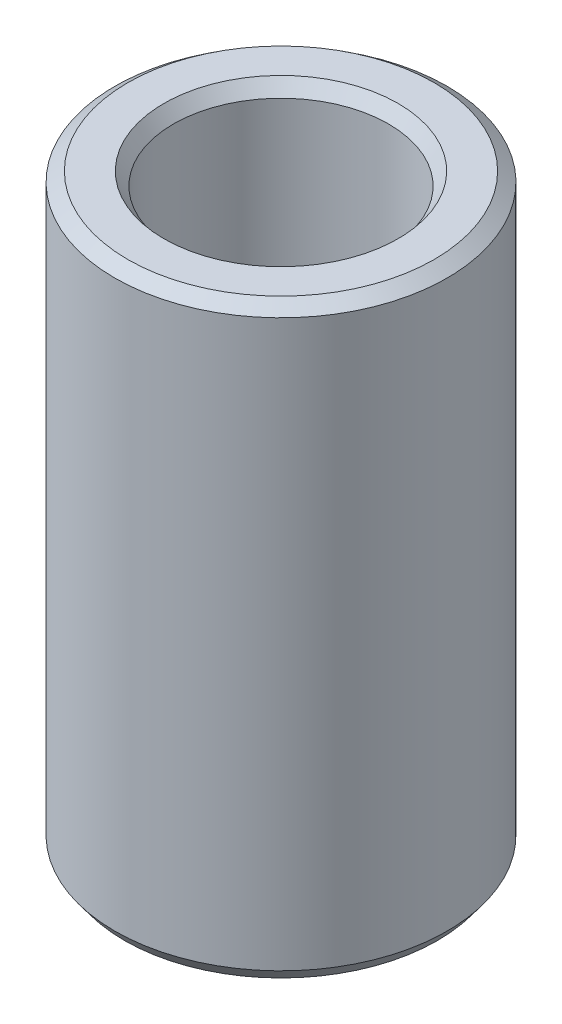
ISO-10303-21;
HEADER;
FILE_DESCRIPTION(('STEP AP214'),'2;1');
FILE_NAME('part.step','',(''),(''),'','','');
FILE_SCHEMA(('AUTOMOTIVE_DESIGN { 1 0 10303 214 1 1 1 1 }'));
ENDSEC;
DATA;
#1=APPLICATION_CONTEXT('core data for automotive mechanical design processes');
#2=APPLICATION_PROTOCOL_DEFINITION('international standard','automotive_design',2000,#1);
#3=PRODUCT_CONTEXT('',#1,'mechanical');
#4=PRODUCT('Part','Part','',(#3));
#5=PRODUCT_RELATED_PRODUCT_CATEGORY('part','',(#4));
#6=PRODUCT_DEFINITION_FORMATION('','',#4);
#7=PRODUCT_DEFINITION_CONTEXT('part definition',#1,'design');
#8=PRODUCT_DEFINITION('design','',#6,#7);
#9=PRODUCT_DEFINITION_SHAPE('','',#8);
#10=(LENGTH_UNIT() NAMED_UNIT(*) SI_UNIT(.MILLI.,.METRE.));
#11=(NAMED_UNIT(*) PLANE_ANGLE_UNIT() SI_UNIT($,.RADIAN.));
#12=(NAMED_UNIT(*) SI_UNIT($,.STERADIAN.) SOLID_ANGLE_UNIT());
#13=UNCERTAINTY_MEASURE_WITH_UNIT(LENGTH_MEASURE(1.E-05),#10,'distance_accuracy_value','');
#14=(GEOMETRIC_REPRESENTATION_CONTEXT(3) GLOBAL_UNCERTAINTY_ASSIGNED_CONTEXT((#13)) GLOBAL_UNIT_ASSIGNED_CONTEXT((#10,
#11,#12)) REPRESENTATION_CONTEXT('',''));
#15=CARTESIAN_POINT('',(0.,0.,0.));
#16=DIRECTION('',(0.,0.,1.));
#17=DIRECTION('',(1.,0.,0.));
#18=AXIS2_PLACEMENT_3D('',#15,#16,#17);
#19=CARTESIAN_POINT('',(0.,132.735458222468,0.));
#20=DIRECTION('',(0.,-1.,0.));
#21=DIRECTION('',(0.,0.,-1.));
#22=AXIS2_PLACEMENT_3D('',#19,#20,#21);
#23=CYLINDRICAL_SURFACE('',#22,37.5);
#24=CARTESIAN_POINT('',(0.,2.92556681524816,0.));
#25=DIRECTION('',(0.,1.,0.));
#26=DIRECTION('',(0.,0.,1.));
#27=AXIS2_PLACEMENT_3D('',#24,#25,#26);
#28=CIRCLE('',#27,37.5);
#29=CARTESIAN_POINT('',(0.,2.92556681524814,-37.5));
#30=VERTEX_POINT('',#29);
#31=EDGE_CURVE('E10',#30,#30,#28,.T.);
#32=CARTESIAN_POINT('',(0.,130.571420907143,0.));
#33=DIRECTION('',(0.,1.,0.));
#34=DIRECTION('',(0.,0.,1.));
#35=AXIS2_PLACEMENT_3D('',#32,#33,#34);
#36=CIRCLE('',#35,37.5);
#37=CARTESIAN_POINT('',(0.,130.571420907143,-37.5));
#38=VERTEX_POINT('',#37);
#39=EDGE_CURVE('E50',#38,#38,#36,.F.);
#40=CARTESIAN_POINT('',(0.,2.92556681524814,-37.5));
#41=CARTESIAN_POINT('',(0.,4.25521112870537,-37.5));
#42=CARTESIAN_POINT('',(0.,5.5848554421626,-37.5));
#43=CARTESIAN_POINT('',(0.,8.24414406907707,-37.5));
#44=CARTESIAN_POINT('',(0.,9.57378838253431,-37.5));
#45=CARTESIAN_POINT('',(0.,12.2330770094488,-37.5));
#46=CARTESIAN_POINT('',(0.,13.562721322906,-37.5));
#47=CARTESIAN_POINT('',(0.,16.2220099498205,-37.5));
#48=CARTESIAN_POINT('',(0.,17.5516542632777,-37.5));
#49=CARTESIAN_POINT('',(0.,20.2109428901922,-37.5));
#50=CARTESIAN_POINT('',(0.,21.5405872036494,-37.5));
#51=CARTESIAN_POINT('',(0.,24.1998758305639,-37.5));
#52=CARTESIAN_POINT('',(0.,25.5295201440211,-37.5));
#53=CARTESIAN_POINT('',(0.,28.1888087709356,-37.5));
#54=CARTESIAN_POINT('',(0.,29.5184530843928,-37.5));
#55=CARTESIAN_POINT('',(0.,32.1777417113073,-37.5));
#56=CARTESIAN_POINT('',(0.,33.5073860247645,-37.5));
#57=CARTESIAN_POINT('',(0.,36.166674651679,-37.5));
#58=CARTESIAN_POINT('',(0.,37.4963189651363,-37.5));
#59=CARTESIAN_POINT('',(0.,40.1556075920507,-37.5));
#60=CARTESIAN_POINT('',(0.,41.485251905508,-37.5));
#61=CARTESIAN_POINT('',(0.,44.1445405324224,-37.5));
#62=CARTESIAN_POINT('',(0.,45.4741848458797,-37.5));
#63=CARTESIAN_POINT('',(0.,48.1334734727941,-37.5));
#64=CARTESIAN_POINT('',(0.,49.4631177862514,-37.5));
#65=CARTESIAN_POINT('',(0.,52.1224064131659,-37.5));
#66=CARTESIAN_POINT('',(0.,53.4520507266231,-37.5));
#67=CARTESIAN_POINT('',(0.,56.1113393535376,-37.5));
#68=CARTESIAN_POINT('',(0.,57.4409836669948,-37.5));
#69=CARTESIAN_POINT('',(0.,60.1002722939093,-37.5));
#70=CARTESIAN_POINT('',(0.,61.4299166073665,-37.5));
#71=CARTESIAN_POINT('',(0.,64.089205234281,-37.5));
#72=CARTESIAN_POINT('',(0.,65.4188495477382,-37.5));
#73=CARTESIAN_POINT('',(0.,68.0781381746527,-37.5));
#74=CARTESIAN_POINT('',(0.,69.4077824881099,-37.5));
#75=CARTESIAN_POINT('',(0.,72.0670711150244,-37.5));
#76=CARTESIAN_POINT('',(0.,73.3967154284816,-37.5));
#77=CARTESIAN_POINT('',(0.,76.0560040553961,-37.5));
#78=CARTESIAN_POINT('',(0.,77.3856483688533,-37.5));
#79=CARTESIAN_POINT('',(0.,80.0449369957678,-37.5));
#80=CARTESIAN_POINT('',(0.,81.3745813092251,-37.5));
#81=CARTESIAN_POINT('',(0.,84.0338699361395,-37.5));
#82=CARTESIAN_POINT('',(0.,85.3635142495967,-37.5));
#83=CARTESIAN_POINT('',(0.,88.0228028765112,-37.5));
#84=CARTESIAN_POINT('',(0.,89.3524471899684,-37.5));
#85=CARTESIAN_POINT('',(0.,92.0117358168829,-37.5));
#86=CARTESIAN_POINT('',(0.,93.3413801303402,-37.5));
#87=CARTESIAN_POINT('',(0.,96.0006687572546,-37.5));
#88=CARTESIAN_POINT('',(0.,97.3303130707119,-37.5));
#89=CARTESIAN_POINT('',(0.,99.9896016976263,-37.5));
#90=CARTESIAN_POINT('',(0.,101.319246011084,-37.5));
#91=CARTESIAN_POINT('',(0.,103.978534637998,-37.5));
#92=CARTESIAN_POINT('',(0.,105.308178951455,-37.5));
#93=CARTESIAN_POINT('',(0.,107.96746757837,-37.5));
#94=CARTESIAN_POINT('',(0.,109.297111891827,-37.5));
#95=CARTESIAN_POINT('',(0.,111.956400518741,-37.5));
#96=CARTESIAN_POINT('',(0.,113.286044832199,-37.5));
#97=CARTESIAN_POINT('',(0.,115.945333459113,-37.5));
#98=CARTESIAN_POINT('',(0.,117.27497777257,-37.5));
#99=CARTESIAN_POINT('',(0.,119.934266399485,-37.5));
#100=CARTESIAN_POINT('',(0.,121.263910712942,-37.5));
#101=CARTESIAN_POINT('',(0.,123.923199339857,-37.5));
#102=CARTESIAN_POINT('',(0.,125.252843653314,-37.5));
#103=CARTESIAN_POINT('',(0.,127.912132280228,-37.5));
#104=CARTESIAN_POINT('',(0.,129.241776593686,-37.5));
#105=CARTESIAN_POINT('',(0.,130.571420907143,-37.5));
#106=B_SPLINE_CURVE_WITH_KNOTS('',3,(#40,#41,#42,#43,#44,#45,#46,#47,#48,#49,#50,#51,#52,#53,
#54,#55,#56,#57,#58,#59,#60,#61,#62,#63,#64,#65,#66,#67,#68,#69,#70,#71,#72,#73,#74,#75,#76,#77,
#78,#79,#80,#81,#82,#83,#84,#85,#86,#87,#88,#89,#90,#91,#92,#93,#94,#95,#96,#97,#98,#99,#100,
#101,#102,#103,#104,#105),.UNSPECIFIED.,.F.,.F.,(4,2,2,2,2,2,2,2,2,2,2,2,2,2,2,2,2,2,2,2,2,2,2,
2,2,2,2,2,2,2,2,2,4),(0.,3.9889329403717,7.97786588074341,11.9667988211151,15.9557317614868,
19.9446647018585,23.9335976422302,27.9225305826019,31.9114635229737,35.9003964633454,
39.8893294037171,43.8782623440888,47.8671952844605,51.8561282248322,55.8450611652039,
59.8339941055756,63.8229270459473,67.811859986319,71.8007929266907,75.7897258670624,
79.7786588074342,83.7675917478059,87.7565246881775,91.7454576285493,95.734390568921,
99.7233235092927,103.712256449664,107.701189390036,111.690122330408,115.67905527078,
119.667988211151,123.656921151523,127.645854091895),.UNSPECIFIED.);
#107=EDGE_CURVE('BSEAM39',#30,#38,#106,.T.);
#108=ORIENTED_EDGE('',*,*,#31,.T.);
#109=ORIENTED_EDGE('',*,*,#39,.T.);
#110=ORIENTED_EDGE('',*,*,#107,.T.);
#111=ORIENTED_EDGE('',*,*,#107,.F.);
#112=EDGE_LOOP('',(#108,#110,#109,#111));
#113=FACE_BOUND('',#112,.T.);
#114=ADVANCED_FACE('F39',(#113),#23,.T.);
#115=CARTESIAN_POINT('',(0.,132.735458222468,0.));
#116=DIRECTION('',(0.,1.,0.));
#117=DIRECTION('',(0.,0.,1.));
#118=AXIS2_PLACEMENT_3D('',#115,#116,#117);
#119=PLANE('',#118);
#120=CARTESIAN_POINT('',(0.,132.735458222468,0.));
#121=DIRECTION('',(0.,1.,0.));
#122=DIRECTION('',(0.,0.,1.));
#123=AXIS2_PLACEMENT_3D('',#120,#121,#122);
#124=CIRCLE('',#123,26.4444026323219);
#125=CARTESIAN_POINT('',(0.,132.735458222468,26.4444026323219));
#126=VERTEX_POINT('',#125);
#127=EDGE_CURVE('E58',#126,#126,#124,.F.);
#128=ORIENTED_EDGE('',*,*,#127,.T.);
#129=EDGE_LOOP('',(#128));
#130=FACE_BOUND('',#129,.T.);
#131=CARTESIAN_POINT('',(0.,132.735458222468,0.));
#132=DIRECTION('',(0.,1.,0.));
#133=DIRECTION('',(0.,0.,1.));
#134=AXIS2_PLACEMENT_3D('',#131,#132,#133);
#135=CIRCLE('',#134,34.5744331847522);
#136=CARTESIAN_POINT('',(0.,132.735458222468,34.5744331847522));
#137=VERTEX_POINT('',#136);
#138=EDGE_CURVE('E61',#137,#137,#135,.T.);
#139=ORIENTED_EDGE('',*,*,#138,.T.);
#140=EDGE_LOOP('',(#139));
#141=FACE_BOUND('',#140,.T.);
#142=ADVANCED_FACE('F88',(#130,#141),#119,.T.);
#143=CARTESIAN_POINT('',(0.,0.,0.));
#144=DIRECTION('',(0.,1.,0.));
#145=DIRECTION('',(0.,0.,1.));
#146=AXIS2_PLACEMENT_3D('',#143,#144,#145);
#147=PLANE('',#146);
#148=CARTESIAN_POINT('',(0.,0.,0.));
#149=DIRECTION('',(0.,1.,0.));
#150=DIRECTION('',(0.,0.,1.));
#151=AXIS2_PLACEMENT_3D('',#148,#149,#150);
#152=CIRCLE('',#151,27.205932132244);
#153=CARTESIAN_POINT('',(0.,0.,27.205932132244));
#154=VERTEX_POINT('',#153);
#155=EDGE_CURVE('E51',#154,#154,#152,.T.);
#156=ORIENTED_EDGE('',*,*,#155,.T.);
#157=EDGE_LOOP('',(#156));
#158=FACE_BOUND('',#157,.T.);
#159=CARTESIAN_POINT('',(0.,0.,0.));
#160=DIRECTION('',(0.,1.,0.));
#161=DIRECTION('',(0.,0.,1.));
#162=AXIS2_PLACEMENT_3D('',#159,#160,#161);
#163=CIRCLE('',#162,35.3359626846742);
#164=CARTESIAN_POINT('',(0.,0.,35.3359626846742));
#165=VERTEX_POINT('',#164);
#166=EDGE_CURVE('E54',#165,#165,#163,.F.);
#167=ORIENTED_EDGE('',*,*,#166,.T.);
#168=EDGE_LOOP('',(#167));
#169=FACE_BOUND('',#168,.T.);
#170=ADVANCED_FACE('F83',(#158,#169),#147,.F.);
#171=CARTESIAN_POINT('',(0.,132.735458222468,0.));
#172=DIRECTION('',(0.,-1.,0.));
#173=DIRECTION('',(0.,0.,-1.));
#174=AXIS2_PLACEMENT_3D('',#171,#172,#173);
#175=CYLINDRICAL_SURFACE('',#174,24.2803653169961);
#176=CARTESIAN_POINT('',(0.,129.80989140722,0.));
#177=DIRECTION('',(0.,1.,0.));
#178=DIRECTION('',(0.,0.,1.));
#179=AXIS2_PLACEMENT_3D('',#176,#177,#178);
#180=CIRCLE('',#179,24.2803653169961);
#181=CARTESIAN_POINT('',(0.,129.80989140722,-24.2803653169961));
#182=VERTEX_POINT('',#181);
#183=EDGE_CURVE('E67',#182,#182,#180,.T.);
#184=CARTESIAN_POINT('',(0.,2.16403731532563,0.));
#185=DIRECTION('',(0.,1.,0.));
#186=DIRECTION('',(0.,0.,1.));
#187=AXIS2_PLACEMENT_3D('',#184,#185,#186);
#188=CIRCLE('',#187,24.2803653169961);
#189=CARTESIAN_POINT('',(0.,2.16403731532561,-24.2803653169961));
#190=VERTEX_POINT('',#189);
#191=EDGE_CURVE('E69',#190,#190,#188,.F.);
#192=CARTESIAN_POINT('',(0.,129.80989140722,-24.2803653169961));
#193=CARTESIAN_POINT('',(0.,128.480247093763,-24.2803653169961));
#194=CARTESIAN_POINT('',(0.,127.150602780306,-24.2803653169961));
#195=CARTESIAN_POINT('',(0.,124.491314153391,-24.2803653169961));
#196=CARTESIAN_POINT('',(0.,123.161669839934,-24.2803653169961));
#197=CARTESIAN_POINT('',(0.,120.50238121302,-24.2803653169961));
#198=CARTESIAN_POINT('',(0.,119.172736899562,-24.2803653169961));
#199=CARTESIAN_POINT('',(0.,116.513448272648,-24.2803653169961));
#200=CARTESIAN_POINT('',(0.,115.183803959191,-24.2803653169961));
#201=CARTESIAN_POINT('',(0.,112.524515332276,-24.2803653169961));
#202=CARTESIAN_POINT('',(0.,111.194871018819,-24.2803653169961));
#203=CARTESIAN_POINT('',(0.,108.535582391905,-24.2803653169961));
#204=CARTESIAN_POINT('',(0.,107.205938078447,-24.2803653169961));
#205=CARTESIAN_POINT('',(0.,104.546649451533,-24.2803653169961));
#206=CARTESIAN_POINT('',(0.,103.217005138076,-24.2803653169961));
#207=CARTESIAN_POINT('',(0.,100.557716511161,-24.2803653169961));
#208=CARTESIAN_POINT('',(0.,99.2280721977039,-24.2803653169961));
#209=CARTESIAN_POINT('',(0.,96.5687835707894,-24.2803653169961));
#210=CARTESIAN_POINT('',(0.,95.2391392573322,-24.2803653169961));
#211=CARTESIAN_POINT('',(0.,92.5798506304177,-24.2803653169961));
#212=CARTESIAN_POINT('',(0.,91.2502063169604,-24.2803653169961));
#213=CARTESIAN_POINT('',(0.,88.590917690046,-24.2803653169961));
#214=CARTESIAN_POINT('',(0.,87.2612733765887,-24.2803653169961));
#215=CARTESIAN_POINT('',(0.,84.6019847496743,-24.2803653169961));
#216=CARTESIAN_POINT('',(0.,83.272340436217,-24.2803653169961));
#217=CARTESIAN_POINT('',(0.,80.6130518093026,-24.2803653169961));
#218=CARTESIAN_POINT('',(0.,79.2834074958453,-24.2803653169961));
#219=CARTESIAN_POINT('',(0.,76.6241188689309,-24.2803653169961));
#220=CARTESIAN_POINT('',(0.,75.2944745554736,-24.2803653169961));
#221=CARTESIAN_POINT('',(0.,72.6351859285592,-24.2803653169961));
#222=CARTESIAN_POINT('',(0.,71.3055416151019,-24.2803653169961));
#223=CARTESIAN_POINT('',(0.,68.6462529881874,-24.2803653169961));
#224=CARTESIAN_POINT('',(0.,67.3166086747302,-24.2803653169961));
#225=CARTESIAN_POINT('',(0.,64.6573200478157,-24.2803653169961));
#226=CARTESIAN_POINT('',(0.,63.3276757343585,-24.2803653169961));
#227=CARTESIAN_POINT('',(0.,60.668387107444,-24.2803653169961));
#228=CARTESIAN_POINT('',(0.,59.3387427939868,-24.2803653169961));
#229=CARTESIAN_POINT('',(0.,56.6794541670723,-24.2803653169961));
#230=CARTESIAN_POINT('',(0.,55.3498098536151,-24.2803653169961));
#231=CARTESIAN_POINT('',(0.,52.6905212267006,-24.2803653169961));
#232=CARTESIAN_POINT('',(0.,51.3608769132434,-24.2803653169961));
#233=CARTESIAN_POINT('',(0.,48.7015882863289,-24.2803653169961));
#234=CARTESIAN_POINT('',(0.,47.3719439728716,-24.2803653169961));
#235=CARTESIAN_POINT('',(0.,44.7126553459572,-24.2803653169961));
#236=CARTESIAN_POINT('',(0.,43.3830110324999,-24.2803653169961));
#237=CARTESIAN_POINT('',(0.,40.7237224055855,-24.2803653169961));
#238=CARTESIAN_POINT('',(0.,39.3940780921282,-24.2803653169961));
#239=CARTESIAN_POINT('',(0.,36.7347894652138,-24.2803653169961));
#240=CARTESIAN_POINT('',(0.,35.4051451517565,-24.2803653169961));
#241=CARTESIAN_POINT('',(0.,32.745856524842,-24.2803653169961));
#242=CARTESIAN_POINT('',(0.,31.4162122113848,-24.2803653169961));
#243=CARTESIAN_POINT('',(0.,28.7569235844703,-24.2803653169961));
#244=CARTESIAN_POINT('',(0.,27.4272792710131,-24.2803653169961));
#245=CARTESIAN_POINT('',(0.,24.7679906440986,-24.2803653169961));
#246=CARTESIAN_POINT('',(0.,23.4383463306414,-24.2803653169961));
#247=CARTESIAN_POINT('',(0.,20.7790577037269,-24.2803653169961));
#248=CARTESIAN_POINT('',(0.,19.4494133902697,-24.2803653169961));
#249=CARTESIAN_POINT('',(0.,16.7901247633552,-24.2803653169961));
#250=CARTESIAN_POINT('',(0.,15.460480449898,-24.2803653169961));
#251=CARTESIAN_POINT('',(0.,12.8011918229835,-24.2803653169961));
#252=CARTESIAN_POINT('',(0.,11.4715475095263,-24.2803653169961));
#253=CARTESIAN_POINT('',(0.,8.8122588826118,-24.2803653169961));
#254=CARTESIAN_POINT('',(0.,7.48261456915457,-24.2803653169961));
#255=CARTESIAN_POINT('',(0.,4.82332594224009,-24.2803653169961));
#256=CARTESIAN_POINT('',(0.,3.49368162878285,-24.2803653169961));
#257=CARTESIAN_POINT('',(0.,2.16403731532561,-24.2803653169961));
#258=B_SPLINE_CURVE_WITH_KNOTS('',3,(#192,#193,#194,#195,#196,#197,#198,#199,#200,#201,#202,
#203,#204,#205,#206,#207,#208,#209,#210,#211,#212,#213,#214,#215,#216,#217,#218,#219,#220,#221,
#222,#223,#224,#225,#226,#227,#228,#229,#230,#231,#232,#233,#234,#235,#236,#237,#238,#239,#240,
#241,#242,#243,#244,#245,#246,#247,#248,#249,#250,#251,#252,#253,#254,#255,#256,#257),
.UNSPECIFIED.,.F.,.F.,(4,2,2,2,2,2,2,2,2,2,2,2,2,2,2,2,2,2,2,2,2,2,2,2,2,2,2,2,2,2,2,2,4),(0.,
3.9889329403717,7.97786588074341,11.9667988211151,15.9557317614868,19.9446647018585,
23.9335976422302,27.922530582602,31.9114635229737,35.9003964633454,39.8893294037171,
43.8782623440888,47.8671952844605,51.8561282248322,55.8450611652039,59.8339941055756,
63.8229270459473,67.811859986319,71.8007929266908,75.7897258670625,79.7786588074342,
83.7675917478059,87.7565246881776,91.7454576285493,95.734390568921,99.7233235092927,
103.712256449664,107.701189390036,111.690122330408,115.67905527078,119.667988211151,
123.656921151523,127.645854091895),.UNSPECIFIED.);
#259=EDGE_CURVE('BSEAM71',#182,#190,#258,.T.);
#260=ORIENTED_EDGE('',*,*,#183,.T.);
#261=ORIENTED_EDGE('',*,*,#191,.T.);
#262=ORIENTED_EDGE('',*,*,#259,.T.);
#263=ORIENTED_EDGE('',*,*,#259,.F.);
#264=EDGE_LOOP('',(#260,#262,#261,#263));
#265=FACE_BOUND('',#264,.T.);
#266=ADVANCED_FACE('F71',(#265),#175,.F.);
#267=CARTESIAN_POINT('',(0.,129.80989140722,0.));
#268=DIRECTION('',(0.,1.,0.));
#269=DIRECTION('',(0.,0.,1.));
#270=AXIS2_PLACEMENT_3D('',#267,#268,#269);
#271=CONICAL_SURFACE('',#270,24.2803653169961,0.636875468037166);
#272=ORIENTED_EDGE('',*,*,#127,.F.);
#273=EDGE_LOOP('',(#272));
#274=FACE_BOUND('',#273,.T.);
#275=ORIENTED_EDGE('',*,*,#183,.F.);
#276=EDGE_LOOP('',(#275));
#277=FACE_BOUND('',#276,.T.);
#278=ADVANCED_FACE('F77',(#274,#277),#271,.F.);
#279=CARTESIAN_POINT('',(0.,0.,0.));
#280=DIRECTION('',(0.,-1.,0.));
#281=DIRECTION('',(0.,0.,-1.));
#282=AXIS2_PLACEMENT_3D('',#279,#280,#281);
#283=CONICAL_SURFACE('',#282,27.205932132244,0.933920858757724);
#284=ORIENTED_EDGE('',*,*,#191,.F.);
#285=EDGE_LOOP('',(#284));
#286=FACE_BOUND('',#285,.T.);
#287=ORIENTED_EDGE('',*,*,#155,.F.);
#288=EDGE_LOOP('',(#287));
#289=FACE_BOUND('',#288,.T.);
#290=ADVANCED_FACE('F73',(#286,#289),#283,.F.);
#291=CARTESIAN_POINT('',(0.,2.92556681524814,0.));
#292=DIRECTION('',(0.,1.,0.));
#293=DIRECTION('',(0.,0.,1.));
#294=AXIS2_PLACEMENT_3D('',#291,#292,#293);
#295=CONICAL_SURFACE('',#294,37.5,0.636875468037176);
#296=ORIENTED_EDGE('',*,*,#166,.F.);
#297=EDGE_LOOP('',(#296));
#298=FACE_BOUND('',#297,.T.);
#299=ORIENTED_EDGE('',*,*,#31,.F.);
#300=EDGE_LOOP('',(#299));
#301=FACE_BOUND('',#300,.T.);
#302=ADVANCED_FACE('F76',(#298,#301),#295,.T.);
#303=CARTESIAN_POINT('',(0.,132.735458222468,0.));
#304=DIRECTION('',(0.,-1.,0.));
#305=DIRECTION('',(0.,0.,-1.));
#306=AXIS2_PLACEMENT_3D('',#303,#304,#305);
#307=CONICAL_SURFACE('',#306,34.5744331847522,0.933920858757728);
#308=ORIENTED_EDGE('',*,*,#39,.F.);
#309=EDGE_LOOP('',(#308));
#310=FACE_BOUND('',#309,.T.);
#311=ORIENTED_EDGE('',*,*,#138,.F.);
#312=EDGE_LOOP('',(#311));
#313=FACE_BOUND('',#312,.T.);
#314=ADVANCED_FACE('F45',(#310,#313),#307,.T.);
#315=CLOSED_SHELL('',(#114,#142,#170,#266,#278,#290,#302,#314));
#316=MANIFOLD_SOLID_BREP('B2',#315);
#317=ADVANCED_BREP_SHAPE_REPRESENTATION('',(#18,#316),#14);
#318=SHAPE_DEFINITION_REPRESENTATION(#9,#317);
ENDSEC;
END-ISO-10303-21;
